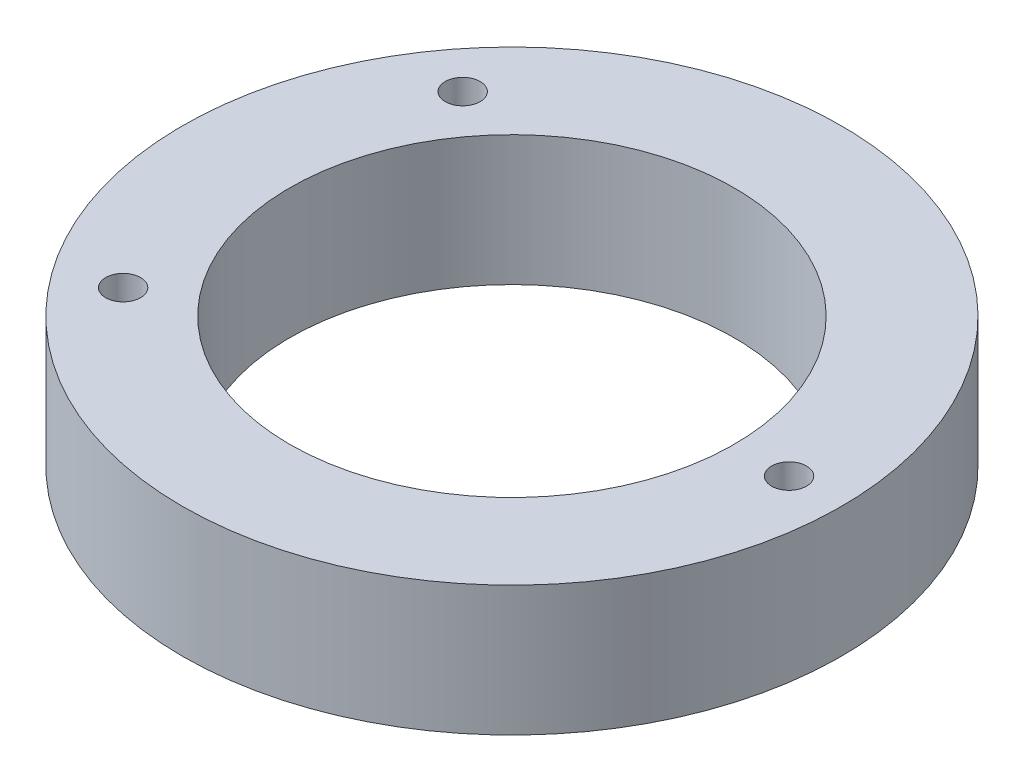
ISO-10303-21;
HEADER;
FILE_DESCRIPTION(('STEP AP214'),'2;1');
FILE_NAME('part.step','',(''),(''),'','','');
FILE_SCHEMA(('AUTOMOTIVE_DESIGN { 1 0 10303 214 1 1 1 1 }'));
ENDSEC;
DATA;
#1=APPLICATION_CONTEXT('core data for automotive mechanical design processes');
#2=APPLICATION_PROTOCOL_DEFINITION('international standard','automotive_design',2000,#1);
#3=PRODUCT_CONTEXT('',#1,'mechanical');
#4=PRODUCT('Part','Part','',(#3));
#5=PRODUCT_RELATED_PRODUCT_CATEGORY('part','',(#4));
#6=PRODUCT_DEFINITION_FORMATION('','',#4);
#7=PRODUCT_DEFINITION_CONTEXT('part definition',#1,'design');
#8=PRODUCT_DEFINITION('design','',#6,#7);
#9=PRODUCT_DEFINITION_SHAPE('','',#8);
#10=(LENGTH_UNIT() NAMED_UNIT(*) SI_UNIT(.MILLI.,.METRE.));
#11=(NAMED_UNIT(*) PLANE_ANGLE_UNIT() SI_UNIT($,.RADIAN.));
#12=(NAMED_UNIT(*) SI_UNIT($,.STERADIAN.) SOLID_ANGLE_UNIT());
#13=UNCERTAINTY_MEASURE_WITH_UNIT(LENGTH_MEASURE(1.E-05),#10,'distance_accuracy_value','');
#14=(GEOMETRIC_REPRESENTATION_CONTEXT(3) GLOBAL_UNCERTAINTY_ASSIGNED_CONTEXT((#13)) GLOBAL_UNIT_ASSIGNED_CONTEXT((#10,
#11,#12)) REPRESENTATION_CONTEXT('',''));
#15=CARTESIAN_POINT('',(0.,0.,0.));
#16=DIRECTION('',(0.,0.,1.));
#17=DIRECTION('',(1.,0.,0.));
#18=AXIS2_PLACEMENT_3D('',#15,#16,#17);
#19=CARTESIAN_POINT('',(0.,13.,0.));
#20=DIRECTION('',(0.,1.,0.));
#21=DIRECTION('',(0.,0.,1.));
#22=AXIS2_PLACEMENT_3D('',#19,#20,#21);
#23=PLANE('',#22);
#24=CARTESIAN_POINT('',(-21.9327372290304,13.,17.0005158051837));
#25=DIRECTION('',(0.,1.,0.));
#26=DIRECTION('',(0.,0.,1.));
#27=AXIS2_PLACEMENT_3D('',#24,#25,#26);
#28=CIRCLE('',#27,1.75);
#29=CARTESIAN_POINT('',(-21.9327372290304,13.,18.7505158051837));
#30=VERTEX_POINT('',#29);
#31=EDGE_CURVE('E64',#30,#30,#28,.T.);
#32=ORIENTED_EDGE('',*,*,#31,.F.);
#33=EDGE_LOOP('',(#32));
#34=FACE_BOUND('',#33,.T.);
#35=CARTESIAN_POINT('',(0.,13.,0.));
#36=DIRECTION('',(0.,1.,0.));
#37=DIRECTION('',(0.,0.,1.));
#38=AXIS2_PLACEMENT_3D('',#35,#36,#37);
#39=CIRCLE('',#38,22.25);
#40=CARTESIAN_POINT('',(0.,13.,22.25));
#41=VERTEX_POINT('',#40);
#42=EDGE_CURVE('E50',#41,#41,#39,.T.);
#43=ORIENTED_EDGE('',*,*,#42,.F.);
#44=EDGE_LOOP('',(#43));
#45=FACE_BOUND('',#44,.T.);
#46=CARTESIAN_POINT('',(0.,13.,0.));
#47=DIRECTION('',(0.,1.,0.));
#48=DIRECTION('',(0.,0.,1.));
#49=AXIS2_PLACEMENT_3D('',#46,#47,#48);
#50=CIRCLE('',#49,33.);
#51=CARTESIAN_POINT('',(0.,13.,33.));
#52=VERTEX_POINT('',#51);
#53=EDGE_CURVE('E10',#52,#52,#50,.T.);
#54=ORIENTED_EDGE('',*,*,#53,.T.);
#55=EDGE_LOOP('',(#54));
#56=FACE_BOUND('',#55,.T.);
#57=CARTESIAN_POINT('',(-21.9327372290304,13.,-17.0005158051838));
#58=DIRECTION('',(0.,1.,0.));
#59=DIRECTION('',(0.,0.,1.));
#60=AXIS2_PLACEMENT_3D('',#57,#58,#59);
#61=CIRCLE('',#60,1.75);
#62=CARTESIAN_POINT('',(-21.9327372290304,13.,-15.2505158051838));
#63=VERTEX_POINT('',#62);
#64=EDGE_CURVE('E56',#63,#63,#61,.T.);
#65=ORIENTED_EDGE('',*,*,#64,.F.);
#66=EDGE_LOOP('',(#65));
#67=FACE_BOUND('',#66,.T.);
#68=CARTESIAN_POINT('',(27.75,13.,0.));
#69=DIRECTION('',(0.,1.,0.));
#70=DIRECTION('',(0.,0.,1.));
#71=AXIS2_PLACEMENT_3D('',#68,#69,#70);
#72=CIRCLE('',#71,1.75);
#73=CARTESIAN_POINT('',(27.75,13.,1.75));
#74=VERTEX_POINT('',#73);
#75=EDGE_CURVE('E72',#74,#74,#72,.T.);
#76=ORIENTED_EDGE('',*,*,#75,.F.);
#77=EDGE_LOOP('',(#76));
#78=FACE_BOUND('',#77,.T.);
#79=ADVANCED_FACE('F37',(#34,#45,#56,#67,#78),#23,.T.);
#80=CARTESIAN_POINT('',(0.,0.,0.));
#81=DIRECTION('',(0.,1.,0.));
#82=DIRECTION('',(0.,0.,1.));
#83=AXIS2_PLACEMENT_3D('',#80,#81,#82);
#84=PLANE('',#83);
#85=CARTESIAN_POINT('',(0.,0.,0.));
#86=DIRECTION('',(0.,1.,0.));
#87=DIRECTION('',(0.,0.,1.));
#88=AXIS2_PLACEMENT_3D('',#85,#86,#87);
#89=CIRCLE('',#88,33.);
#90=CARTESIAN_POINT('',(0.,0.,33.));
#91=VERTEX_POINT('',#90);
#92=EDGE_CURVE('E41',#91,#91,#89,.T.);
#93=ORIENTED_EDGE('',*,*,#92,.F.);
#94=EDGE_LOOP('',(#93));
#95=FACE_BOUND('',#94,.T.);
#96=CARTESIAN_POINT('',(0.,0.,0.));
#97=DIRECTION('',(0.,1.,0.));
#98=DIRECTION('',(0.,0.,1.));
#99=AXIS2_PLACEMENT_3D('',#96,#97,#98);
#100=CIRCLE('',#99,22.25);
#101=CARTESIAN_POINT('',(0.,0.,22.25));
#102=VERTEX_POINT('',#101);
#103=EDGE_CURVE('E52',#102,#102,#100,.T.);
#104=ORIENTED_EDGE('',*,*,#103,.T.);
#105=EDGE_LOOP('',(#104));
#106=FACE_BOUND('',#105,.T.);
#107=CARTESIAN_POINT('',(-21.9327372290304,0.,-17.0005158051838));
#108=DIRECTION('',(0.,1.,0.));
#109=DIRECTION('',(0.,0.,1.));
#110=AXIS2_PLACEMENT_3D('',#107,#108,#109);
#111=CIRCLE('',#110,1.75);
#112=CARTESIAN_POINT('',(-21.9327372290304,0.,-15.2505158051838));
#113=VERTEX_POINT('',#112);
#114=EDGE_CURVE('E60',#113,#113,#111,.T.);
#115=ORIENTED_EDGE('',*,*,#114,.T.);
#116=EDGE_LOOP('',(#115));
#117=FACE_BOUND('',#116,.T.);
#118=CARTESIAN_POINT('',(-21.9327372290304,0.,17.0005158051837));
#119=DIRECTION('',(0.,1.,0.));
#120=DIRECTION('',(0.,0.,1.));
#121=AXIS2_PLACEMENT_3D('',#118,#119,#120);
#122=CIRCLE('',#121,1.75);
#123=CARTESIAN_POINT('',(-21.9327372290304,0.,18.7505158051837));
#124=VERTEX_POINT('',#123);
#125=EDGE_CURVE('E68',#124,#124,#122,.T.);
#126=ORIENTED_EDGE('',*,*,#125,.T.);
#127=EDGE_LOOP('',(#126));
#128=FACE_BOUND('',#127,.T.);
#129=CARTESIAN_POINT('',(27.75,0.,0.));
#130=DIRECTION('',(0.,1.,0.));
#131=DIRECTION('',(0.,0.,1.));
#132=AXIS2_PLACEMENT_3D('',#129,#130,#131);
#133=CIRCLE('',#132,1.75);
#134=CARTESIAN_POINT('',(27.75,0.,1.75));
#135=VERTEX_POINT('',#134);
#136=EDGE_CURVE('E76',#135,#135,#133,.T.);
#137=ORIENTED_EDGE('',*,*,#136,.T.);
#138=EDGE_LOOP('',(#137));
#139=FACE_BOUND('',#138,.T.);
#140=ADVANCED_FACE('F88',(#95,#106,#117,#128,#139),#84,.F.);
#141=CARTESIAN_POINT('',(0.,13.,0.));
#142=DIRECTION('',(0.,-1.,0.));
#143=DIRECTION('',(0.,0.,-1.));
#144=AXIS2_PLACEMENT_3D('',#141,#142,#143);
#145=CYLINDRICAL_SURFACE('',#144,33.);
#146=ORIENTED_EDGE('',*,*,#53,.F.);
#147=EDGE_LOOP('',(#146));
#148=FACE_BOUND('',#147,.T.);
#149=ORIENTED_EDGE('',*,*,#92,.T.);
#150=EDGE_LOOP('',(#149));
#151=FACE_BOUND('',#150,.T.);
#152=ADVANCED_FACE('F39',(#148,#151),#145,.T.);
#153=CARTESIAN_POINT('',(0.,13.,0.));
#154=DIRECTION('',(0.,-1.,0.));
#155=DIRECTION('',(0.,0.,-1.));
#156=AXIS2_PLACEMENT_3D('',#153,#154,#155);
#157=CYLINDRICAL_SURFACE('',#156,22.25);
#158=ORIENTED_EDGE('',*,*,#42,.T.);
#159=EDGE_LOOP('',(#158));
#160=FACE_BOUND('',#159,.T.);
#161=ORIENTED_EDGE('',*,*,#103,.F.);
#162=EDGE_LOOP('',(#161));
#163=FACE_BOUND('',#162,.T.);
#164=ADVANCED_FACE('F98',(#160,#163),#157,.F.);
#165=CARTESIAN_POINT('',(-21.9327372290304,13.,-17.0005158051838));
#166=DIRECTION('',(0.,-1.,0.));
#167=DIRECTION('',(0.,0.,-1.));
#168=AXIS2_PLACEMENT_3D('',#165,#166,#167);
#169=CYLINDRICAL_SURFACE('',#168,1.75);
#170=ORIENTED_EDGE('',*,*,#64,.T.);
#171=EDGE_LOOP('',(#170));
#172=FACE_BOUND('',#171,.T.);
#173=ORIENTED_EDGE('',*,*,#114,.F.);
#174=EDGE_LOOP('',(#173));
#175=FACE_BOUND('',#174,.T.);
#176=ADVANCED_FACE('F101',(#172,#175),#169,.F.);
#177=CARTESIAN_POINT('',(-21.9327372290304,13.,17.0005158051837));
#178=DIRECTION('',(0.,-1.,0.));
#179=DIRECTION('',(0.,0.,-1.));
#180=AXIS2_PLACEMENT_3D('',#177,#178,#179);
#181=CYLINDRICAL_SURFACE('',#180,1.75);
#182=ORIENTED_EDGE('',*,*,#31,.T.);
#183=EDGE_LOOP('',(#182));
#184=FACE_BOUND('',#183,.T.);
#185=ORIENTED_EDGE('',*,*,#125,.F.);
#186=EDGE_LOOP('',(#185));
#187=FACE_BOUND('',#186,.T.);
#188=ADVANCED_FACE('F105',(#184,#187),#181,.F.);
#189=CARTESIAN_POINT('',(27.75,13.,0.));
#190=DIRECTION('',(0.,-1.,0.));
#191=DIRECTION('',(0.,0.,-1.));
#192=AXIS2_PLACEMENT_3D('',#189,#190,#191);
#193=CYLINDRICAL_SURFACE('',#192,1.75);
#194=ORIENTED_EDGE('',*,*,#75,.T.);
#195=EDGE_LOOP('',(#194));
#196=FACE_BOUND('',#195,.T.);
#197=ORIENTED_EDGE('',*,*,#136,.F.);
#198=EDGE_LOOP('',(#197));
#199=FACE_BOUND('',#198,.T.);
#200=ADVANCED_FACE('F84',(#196,#199),#193,.F.);
#201=CLOSED_SHELL('',(#79,#140,#152,#164,#176,#188,#200));
#202=MANIFOLD_SOLID_BREP('B2',#201);
#203=ADVANCED_BREP_SHAPE_REPRESENTATION('',(#18,#202),#14);
#204=SHAPE_DEFINITION_REPRESENTATION(#9,#203);
ENDSEC;
END-ISO-10303-21;
